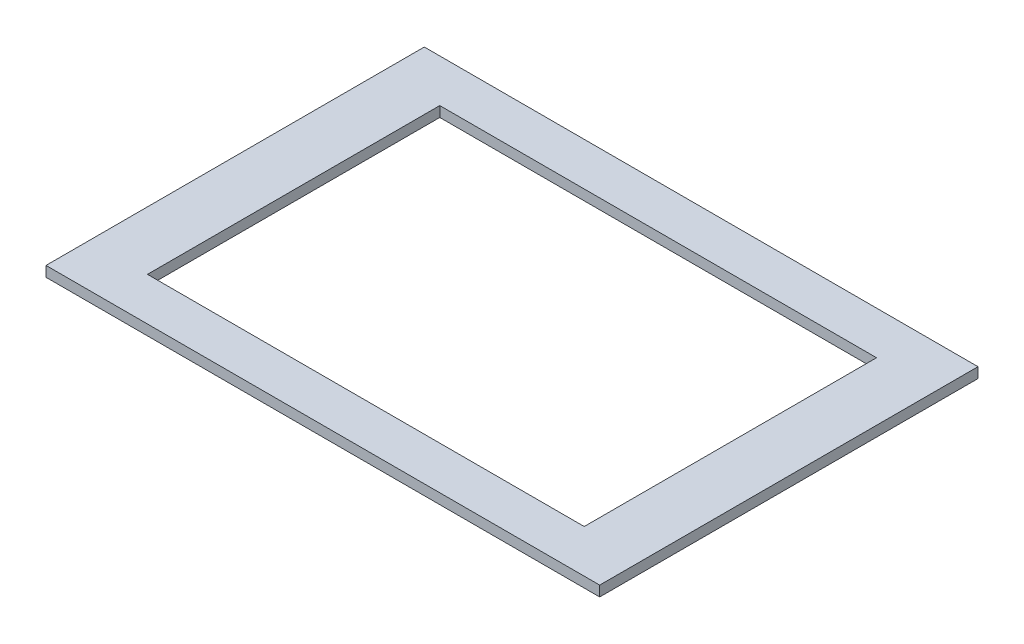
ISO-10303-21;
HEADER;
FILE_DESCRIPTION(('STEP AP214'),'2;1');
FILE_NAME('part.step','',(''),(''),'','','');
FILE_SCHEMA(('AUTOMOTIVE_DESIGN { 1 0 10303 214 1 1 1 1 }'));
ENDSEC;
DATA;
#1=APPLICATION_CONTEXT('core data for automotive mechanical design processes');
#2=APPLICATION_PROTOCOL_DEFINITION('international standard','automotive_design',2000,#1);
#3=PRODUCT_CONTEXT('',#1,'mechanical');
#4=PRODUCT('Part','Part','',(#3));
#5=PRODUCT_RELATED_PRODUCT_CATEGORY('part','',(#4));
#6=PRODUCT_DEFINITION_FORMATION('','',#4);
#7=PRODUCT_DEFINITION_CONTEXT('part definition',#1,'design');
#8=PRODUCT_DEFINITION('design','',#6,#7);
#9=PRODUCT_DEFINITION_SHAPE('','',#8);
#10=(LENGTH_UNIT() NAMED_UNIT(*) SI_UNIT(.MILLI.,.METRE.));
#11=(NAMED_UNIT(*) PLANE_ANGLE_UNIT() SI_UNIT($,.RADIAN.));
#12=(NAMED_UNIT(*) SI_UNIT($,.STERADIAN.) SOLID_ANGLE_UNIT());
#13=UNCERTAINTY_MEASURE_WITH_UNIT(LENGTH_MEASURE(1.E-05),#10,'distance_accuracy_value','');
#14=(GEOMETRIC_REPRESENTATION_CONTEXT(3) GLOBAL_UNCERTAINTY_ASSIGNED_CONTEXT((#13)) GLOBAL_UNIT_ASSIGNED_CONTEXT((#10,
#11,#12)) REPRESENTATION_CONTEXT('',''));
#15=CARTESIAN_POINT('',(0.,0.,0.));
#16=DIRECTION('',(0.,0.,1.));
#17=DIRECTION('',(1.,0.,0.));
#18=AXIS2_PLACEMENT_3D('',#15,#16,#17);
#19=CARTESIAN_POINT('',(252.10264215657,0.,-41.4684898929856));
#20=DIRECTION('',(0.,0.,-1.));
#21=DIRECTION('',(-1.,0.,0.));
#22=AXIS2_PLACEMENT_3D('',#19,#20,#21);
#23=PLANE('',#22);
#24=DIRECTION('',(-1.,0.,0.));
#25=VECTOR('',#24,1.);
#26=CARTESIAN_POINT('',(252.10264215657,3.,-41.4684898929856));
#27=LINE('',#26,#25);
#28=CARTESIAN_POINT('',(252.10264215657,3.,-41.4684898929856));
#29=VERTEX_POINT('',#28);
#30=CARTESIAN_POINT('',(91.1026421565702,3.,-41.4684898929856));
#31=VERTEX_POINT('',#30);
#32=EDGE_CURVE('E146',#29,#31,#27,.T.);
#33=ORIENTED_EDGE('',*,*,#32,.F.);
#34=DIRECTION('',(0.,1.,0.));
#35=VECTOR('',#34,1.);
#36=CARTESIAN_POINT('',(252.10264215657,0.,-41.4684898929856));
#37=LINE('',#36,#35);
#38=CARTESIAN_POINT('',(252.10264215657,0.,-41.4684898929856));
#39=VERTEX_POINT('',#38);
#40=EDGE_CURVE('E11',#39,#29,#37,.T.);
#41=ORIENTED_EDGE('',*,*,#40,.F.);
#42=DIRECTION('',(-1.,0.,0.));
#43=VECTOR('',#42,1.);
#44=CARTESIAN_POINT('',(252.10264215657,0.,-41.4684898929856));
#45=LINE('',#44,#43);
#46=CARTESIAN_POINT('',(91.1026421565702,0.,-41.4684898929856));
#47=VERTEX_POINT('',#46);
#48=EDGE_CURVE('E152',#39,#47,#45,.T.);
#49=ORIENTED_EDGE('',*,*,#48,.T.);
#50=DIRECTION('',(0.,1.,0.));
#51=VECTOR('',#50,1.);
#52=CARTESIAN_POINT('',(91.1026421565702,0.,-41.4684898929856));
#53=LINE('',#52,#51);
#54=EDGE_CURVE('E39',#47,#31,#53,.T.);
#55=ORIENTED_EDGE('',*,*,#54,.T.);
#56=EDGE_LOOP('',(#33,#41,#49,#55));
#57=FACE_BOUND('',#56,.T.);
#58=ADVANCED_FACE('F36',(#57),#23,.T.);
#59=CARTESIAN_POINT('',(252.10264215657,0.,-41.4684898929856));
#60=DIRECTION('',(1.,0.,0.));
#61=DIRECTION('',(0.,0.,-1.));
#62=AXIS2_PLACEMENT_3D('',#59,#60,#61);
#63=PLANE('',#62);
#64=DIRECTION('',(0.,0.,-1.));
#65=VECTOR('',#64,1.);
#66=CARTESIAN_POINT('',(252.10264215657,3.,-41.4684898929856));
#67=LINE('',#66,#65);
#68=CARTESIAN_POINT('',(252.10264215657,3.,68.5315101070144));
#69=VERTEX_POINT('',#68);
#70=EDGE_CURVE('E157',#69,#29,#67,.T.);
#71=ORIENTED_EDGE('',*,*,#70,.F.);
#72=DIRECTION('',(0.,1.,0.));
#73=VECTOR('',#72,1.);
#74=CARTESIAN_POINT('',(252.10264215657,0.,68.5315101070144));
#75=LINE('',#74,#73);
#76=CARTESIAN_POINT('',(252.10264215657,0.,68.5315101070144));
#77=VERTEX_POINT('',#76);
#78=EDGE_CURVE('E45',#77,#69,#75,.T.);
#79=ORIENTED_EDGE('',*,*,#78,.F.);
#80=DIRECTION('',(0.,0.,-1.));
#81=VECTOR('',#80,1.);
#82=CARTESIAN_POINT('',(252.10264215657,0.,-41.4684898929856));
#83=LINE('',#82,#81);
#84=EDGE_CURVE('E165',#77,#39,#83,.T.);
#85=ORIENTED_EDGE('',*,*,#84,.T.);
#86=ORIENTED_EDGE('',*,*,#40,.T.);
#87=EDGE_LOOP('',(#71,#79,#85,#86));
#88=FACE_BOUND('',#87,.T.);
#89=ADVANCED_FACE('F201',(#88),#63,.T.);
#90=CARTESIAN_POINT('',(252.10264215657,0.,68.5315101070144));
#91=DIRECTION('',(0.,0.,1.));
#92=DIRECTION('',(1.,0.,0.));
#93=AXIS2_PLACEMENT_3D('',#90,#91,#92);
#94=PLANE('',#93);
#95=DIRECTION('',(1.,0.,0.));
#96=VECTOR('',#95,1.);
#97=CARTESIAN_POINT('',(252.10264215657,3.,68.5315101070144));
#98=LINE('',#97,#96);
#99=CARTESIAN_POINT('',(91.1026421565702,3.,68.5315101070144));
#100=VERTEX_POINT('',#99);
#101=EDGE_CURVE('E176',#100,#69,#98,.T.);
#102=ORIENTED_EDGE('',*,*,#101,.F.);
#103=DIRECTION('',(0.,1.,0.));
#104=VECTOR('',#103,1.);
#105=CARTESIAN_POINT('',(91.1026421565702,0.,68.5315101070144));
#106=LINE('',#105,#104);
#107=CARTESIAN_POINT('',(91.1026421565702,0.,68.5315101070144));
#108=VERTEX_POINT('',#107);
#109=EDGE_CURVE('E184',#108,#100,#106,.T.);
#110=ORIENTED_EDGE('',*,*,#109,.F.);
#111=DIRECTION('',(1.,0.,0.));
#112=VECTOR('',#111,1.);
#113=CARTESIAN_POINT('',(252.10264215657,0.,68.5315101070144));
#114=LINE('',#113,#112);
#115=EDGE_CURVE('E161',#108,#77,#114,.T.);
#116=ORIENTED_EDGE('',*,*,#115,.T.);
#117=ORIENTED_EDGE('',*,*,#78,.T.);
#118=EDGE_LOOP('',(#102,#110,#116,#117));
#119=FACE_BOUND('',#118,.T.);
#120=ADVANCED_FACE('F205',(#119),#94,.T.);
#121=CARTESIAN_POINT('',(91.1026421565702,0.,-41.4684898929856));
#122=DIRECTION('',(-1.,0.,0.));
#123=DIRECTION('',(0.,0.,1.));
#124=AXIS2_PLACEMENT_3D('',#121,#122,#123);
#125=PLANE('',#124);
#126=DIRECTION('',(0.,0.,1.));
#127=VECTOR('',#126,1.);
#128=CARTESIAN_POINT('',(91.1026421565702,3.,-41.4684898929856));
#129=LINE('',#128,#127);
#130=EDGE_CURVE('E172',#31,#100,#129,.T.);
#131=ORIENTED_EDGE('',*,*,#130,.F.);
#132=ORIENTED_EDGE('',*,*,#54,.F.);
#133=DIRECTION('',(0.,0.,1.));
#134=VECTOR('',#133,1.);
#135=CARTESIAN_POINT('',(91.1026421565702,0.,-41.4684898929856));
#136=LINE('',#135,#134);
#137=EDGE_CURVE('E156',#47,#108,#136,.T.);
#138=ORIENTED_EDGE('',*,*,#137,.T.);
#139=ORIENTED_EDGE('',*,*,#109,.T.);
#140=EDGE_LOOP('',(#131,#132,#138,#139));
#141=FACE_BOUND('',#140,.T.);
#142=ADVANCED_FACE('F196',(#141),#125,.T.);
#143=CARTESIAN_POINT('',(0.,0.,0.));
#144=DIRECTION('',(0.,1.,0.));
#145=DIRECTION('',(0.,0.,1.));
#146=AXIS2_PLACEMENT_3D('',#143,#144,#145);
#147=PLANE('',#146);
#148=DIRECTION('',(1.,0.,0.));
#149=VECTOR('',#148,1.);
#150=CARTESIAN_POINT('',(235.10264215657,0.,56.0315101070148));
#151=LINE('',#150,#149);
#152=CARTESIAN_POINT('',(108.10264215657,0.,56.0315101070148));
#153=VERTEX_POINT('',#152);
#154=CARTESIAN_POINT('',(235.10264215657,0.,56.0315101070148));
#155=VERTEX_POINT('',#154);
#156=EDGE_CURVE('E111',#153,#155,#151,.T.);
#157=ORIENTED_EDGE('',*,*,#156,.T.);
#158=DIRECTION('',(0.,0.,-1.));
#159=VECTOR('',#158,1.);
#160=CARTESIAN_POINT('',(235.10264215657,0.,-28.9684898929852));
#161=LINE('',#160,#159);
#162=CARTESIAN_POINT('',(235.10264215657,0.,-28.9684898929852));
#163=VERTEX_POINT('',#162);
#164=EDGE_CURVE('E104',#155,#163,#161,.T.);
#165=ORIENTED_EDGE('',*,*,#164,.T.);
#166=DIRECTION('',(-1.,0.,0.));
#167=VECTOR('',#166,1.);
#168=CARTESIAN_POINT('',(235.10264215657,0.,-28.9684898929852));
#169=LINE('',#168,#167);
#170=CARTESIAN_POINT('',(108.10264215657,0.,-28.9684898929852));
#171=VERTEX_POINT('',#170);
#172=EDGE_CURVE('E114',#163,#171,#169,.T.);
#173=ORIENTED_EDGE('',*,*,#172,.T.);
#174=DIRECTION('',(0.,0.,1.));
#175=VECTOR('',#174,1.);
#176=CARTESIAN_POINT('',(108.10264215657,0.,-28.9684898929852));
#177=LINE('',#176,#175);
#178=EDGE_CURVE('E53',#171,#153,#177,.T.);
#179=ORIENTED_EDGE('',*,*,#178,.T.);
#180=EDGE_LOOP('',(#157,#165,#173,#179));
#181=FACE_BOUND('',#180,.T.);
#182=ORIENTED_EDGE('',*,*,#48,.F.);
#183=ORIENTED_EDGE('',*,*,#84,.F.);
#184=ORIENTED_EDGE('',*,*,#115,.F.);
#185=ORIENTED_EDGE('',*,*,#137,.F.);
#186=EDGE_LOOP('',(#182,#183,#184,#185));
#187=FACE_BOUND('',#186,.T.);
#188=ADVANCED_FACE('F119',(#181,#187),#147,.F.);
#189=CARTESIAN_POINT('',(0.,3.,0.));
#190=DIRECTION('',(0.,1.,0.));
#191=DIRECTION('',(0.,0.,1.));
#192=AXIS2_PLACEMENT_3D('',#189,#190,#191);
#193=PLANE('',#192);
#194=DIRECTION('',(0.,0.,-1.));
#195=VECTOR('',#194,1.);
#196=CARTESIAN_POINT('',(235.10264215657,3.,-28.9684898929852));
#197=LINE('',#196,#195);
#198=CARTESIAN_POINT('',(235.10264215657,3.,56.0315101070148));
#199=VERTEX_POINT('',#198);
#200=CARTESIAN_POINT('',(235.10264215657,3.,-28.9684898929852));
#201=VERTEX_POINT('',#200);
#202=EDGE_CURVE('E61',#199,#201,#197,.T.);
#203=ORIENTED_EDGE('',*,*,#202,.F.);
#204=DIRECTION('',(1.,0.,0.));
#205=VECTOR('',#204,1.);
#206=CARTESIAN_POINT('',(235.10264215657,3.,56.0315101070148));
#207=LINE('',#206,#205);
#208=CARTESIAN_POINT('',(108.10264215657,3.,56.0315101070148));
#209=VERTEX_POINT('',#208);
#210=EDGE_CURVE('E123',#209,#199,#207,.T.);
#211=ORIENTED_EDGE('',*,*,#210,.F.);
#212=DIRECTION('',(0.,0.,1.));
#213=VECTOR('',#212,1.);
#214=CARTESIAN_POINT('',(108.10264215657,3.,-28.9684898929852));
#215=LINE('',#214,#213);
#216=CARTESIAN_POINT('',(108.10264215657,3.,-28.9684898929852));
#217=VERTEX_POINT('',#216);
#218=EDGE_CURVE('E128',#217,#209,#215,.T.);
#219=ORIENTED_EDGE('',*,*,#218,.F.);
#220=DIRECTION('',(-1.,0.,0.));
#221=VECTOR('',#220,1.);
#222=CARTESIAN_POINT('',(235.10264215657,3.,-28.9684898929852));
#223=LINE('',#222,#221);
#224=EDGE_CURVE('E137',#201,#217,#223,.T.);
#225=ORIENTED_EDGE('',*,*,#224,.F.);
#226=EDGE_LOOP('',(#203,#211,#219,#225));
#227=FACE_BOUND('',#226,.T.);
#228=ORIENTED_EDGE('',*,*,#32,.T.);
#229=ORIENTED_EDGE('',*,*,#130,.T.);
#230=ORIENTED_EDGE('',*,*,#101,.T.);
#231=ORIENTED_EDGE('',*,*,#70,.T.);
#232=EDGE_LOOP('',(#228,#229,#230,#231));
#233=FACE_BOUND('',#232,.T.);
#234=ADVANCED_FACE('F198',(#227,#233),#193,.T.);
#235=CARTESIAN_POINT('',(235.10264215657,0.,-28.9684898929852));
#236=DIRECTION('',(1.,0.,0.));
#237=DIRECTION('',(0.,0.,-1.));
#238=AXIS2_PLACEMENT_3D('',#235,#236,#237);
#239=PLANE('',#238);
#240=ORIENTED_EDGE('',*,*,#202,.T.);
#241=DIRECTION('',(0.,1.,0.));
#242=VECTOR('',#241,1.);
#243=CARTESIAN_POINT('',(235.10264215657,0.,-28.9684898929852));
#244=LINE('',#243,#242);
#245=EDGE_CURVE('E100',#163,#201,#244,.T.);
#246=ORIENTED_EDGE('',*,*,#245,.F.);
#247=ORIENTED_EDGE('',*,*,#164,.F.);
#248=DIRECTION('',(0.,1.,0.));
#249=VECTOR('',#248,1.);
#250=CARTESIAN_POINT('',(235.10264215657,0.,56.0315101070148));
#251=LINE('',#250,#249);
#252=EDGE_CURVE('E143',#155,#199,#251,.T.);
#253=ORIENTED_EDGE('',*,*,#252,.T.);
#254=EDGE_LOOP('',(#240,#246,#247,#253));
#255=FACE_BOUND('',#254,.T.);
#256=ADVANCED_FACE('F102',(#255),#239,.F.);
#257=CARTESIAN_POINT('',(235.10264215657,0.,56.0315101070148));
#258=DIRECTION('',(0.,0.,1.));
#259=DIRECTION('',(1.,0.,0.));
#260=AXIS2_PLACEMENT_3D('',#257,#258,#259);
#261=PLANE('',#260);
#262=ORIENTED_EDGE('',*,*,#210,.T.);
#263=ORIENTED_EDGE('',*,*,#252,.F.);
#264=ORIENTED_EDGE('',*,*,#156,.F.);
#265=DIRECTION('',(0.,1.,0.));
#266=VECTOR('',#265,1.);
#267=CARTESIAN_POINT('',(108.10264215657,0.,56.0315101070148));
#268=LINE('',#267,#266);
#269=EDGE_CURVE('E147',#153,#209,#268,.T.);
#270=ORIENTED_EDGE('',*,*,#269,.T.);
#271=EDGE_LOOP('',(#262,#263,#264,#270));
#272=FACE_BOUND('',#271,.T.);
#273=ADVANCED_FACE('F256',(#272),#261,.F.);
#274=CARTESIAN_POINT('',(108.10264215657,0.,-28.9684898929852));
#275=DIRECTION('',(-1.,0.,0.));
#276=DIRECTION('',(0.,0.,1.));
#277=AXIS2_PLACEMENT_3D('',#274,#275,#276);
#278=PLANE('',#277);
#279=ORIENTED_EDGE('',*,*,#218,.T.);
#280=ORIENTED_EDGE('',*,*,#269,.F.);
#281=ORIENTED_EDGE('',*,*,#178,.F.);
#282=DIRECTION('',(0.,1.,0.));
#283=VECTOR('',#282,1.);
#284=CARTESIAN_POINT('',(108.10264215657,0.,-28.9684898929852));
#285=LINE('',#284,#283);
#286=EDGE_CURVE('E110',#171,#217,#285,.T.);
#287=ORIENTED_EDGE('',*,*,#286,.T.);
#288=EDGE_LOOP('',(#279,#280,#281,#287));
#289=FACE_BOUND('',#288,.T.);
#290=ADVANCED_FACE('F265',(#289),#278,.F.);
#291=CARTESIAN_POINT('',(235.10264215657,0.,-28.9684898929852));
#292=DIRECTION('',(0.,0.,-1.));
#293=DIRECTION('',(-1.,0.,0.));
#294=AXIS2_PLACEMENT_3D('',#291,#292,#293);
#295=PLANE('',#294);
#296=ORIENTED_EDGE('',*,*,#224,.T.);
#297=ORIENTED_EDGE('',*,*,#286,.F.);
#298=ORIENTED_EDGE('',*,*,#172,.F.);
#299=ORIENTED_EDGE('',*,*,#245,.T.);
#300=EDGE_LOOP('',(#296,#297,#298,#299));
#301=FACE_BOUND('',#300,.T.);
#302=ADVANCED_FACE('F115',(#301),#295,.F.);
#303=CLOSED_SHELL('',(#58,#89,#120,#142,#188,#234,#256,#273,#290,#302));
#304=MANIFOLD_SOLID_BREP('B2',#303);
#305=ADVANCED_BREP_SHAPE_REPRESENTATION('',(#18,#304),#14);
#306=SHAPE_DEFINITION_REPRESENTATION(#9,#305);
ENDSEC;
END-ISO-10303-21;
